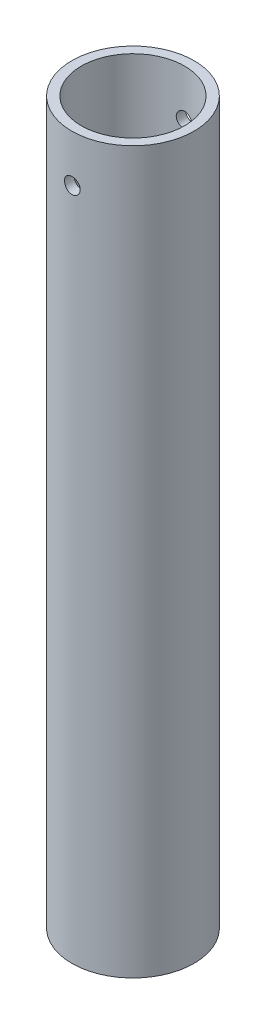
ISO-10303-21;
HEADER;
FILE_DESCRIPTION(('STEP AP214'),'2;1');
FILE_NAME('part.step','',(''),(''),'','','');
FILE_SCHEMA(('AUTOMOTIVE_DESIGN { 1 0 10303 214 1 1 1 1 }'));
ENDSEC;
DATA;
#1=APPLICATION_CONTEXT('core data for automotive mechanical design processes');
#2=APPLICATION_PROTOCOL_DEFINITION('international standard','automotive_design',2000,#1);
#3=PRODUCT_CONTEXT('',#1,'mechanical');
#4=PRODUCT('Part','Part','',(#3));
#5=PRODUCT_RELATED_PRODUCT_CATEGORY('part','',(#4));
#6=PRODUCT_DEFINITION_FORMATION('','',#4);
#7=PRODUCT_DEFINITION_CONTEXT('part definition',#1,'design');
#8=PRODUCT_DEFINITION('design','',#6,#7);
#9=PRODUCT_DEFINITION_SHAPE('','',#8);
#10=(LENGTH_UNIT() NAMED_UNIT(*) SI_UNIT(.MILLI.,.METRE.));
#11=(NAMED_UNIT(*) PLANE_ANGLE_UNIT() SI_UNIT($,.RADIAN.));
#12=(NAMED_UNIT(*) SI_UNIT($,.STERADIAN.) SOLID_ANGLE_UNIT());
#13=UNCERTAINTY_MEASURE_WITH_UNIT(LENGTH_MEASURE(1.E-05),#10,'distance_accuracy_value','');
#14=(GEOMETRIC_REPRESENTATION_CONTEXT(3) GLOBAL_UNCERTAINTY_ASSIGNED_CONTEXT((#13)) GLOBAL_UNIT_ASSIGNED_CONTEXT((#10,
#11,#12)) REPRESENTATION_CONTEXT('',''));
#15=CARTESIAN_POINT('',(0.,0.,0.));
#16=DIRECTION('',(0.,0.,1.));
#17=DIRECTION('',(1.,0.,0.));
#18=AXIS2_PLACEMENT_3D('',#15,#16,#17);
#19=CARTESIAN_POINT('',(0.,230.,0.));
#20=DIRECTION('',(0.,1.,0.));
#21=DIRECTION('',(0.,0.,1.));
#22=AXIS2_PLACEMENT_3D('',#19,#20,#21);
#23=PLANE('',#22);
#24=CARTESIAN_POINT('',(0.,230.,0.));
#25=DIRECTION('',(0.,1.,0.));
#26=DIRECTION('',(0.,0.,1.));
#27=AXIS2_PLACEMENT_3D('',#24,#25,#26);
#28=CIRCLE('',#27,19.5);
#29=CARTESIAN_POINT('',(0.,230.,19.5));
#30=VERTEX_POINT('',#29);
#31=EDGE_CURVE('E10',#30,#30,#28,.T.);
#32=ORIENTED_EDGE('',*,*,#31,.T.);
#33=EDGE_LOOP('',(#32));
#34=FACE_BOUND('',#33,.T.);
#35=CARTESIAN_POINT('',(0.,230.,0.));
#36=DIRECTION('',(0.,1.,0.));
#37=DIRECTION('',(0.,0.,1.));
#38=AXIS2_PLACEMENT_3D('',#35,#36,#37);
#39=CIRCLE('',#38,16.5);
#40=CARTESIAN_POINT('',(0.,230.,16.5));
#41=VERTEX_POINT('',#40);
#42=EDGE_CURVE('E57',#41,#41,#39,.T.);
#43=ORIENTED_EDGE('',*,*,#42,.F.);
#44=EDGE_LOOP('',(#43));
#45=FACE_BOUND('',#44,.T.);
#46=ADVANCED_FACE('F36',(#34,#45),#23,.T.);
#47=CARTESIAN_POINT('',(0.,0.,0.));
#48=DIRECTION('',(0.,1.,0.));
#49=DIRECTION('',(0.,0.,1.));
#50=AXIS2_PLACEMENT_3D('',#47,#48,#49);
#51=PLANE('',#50);
#52=CARTESIAN_POINT('',(0.,0.,0.));
#53=DIRECTION('',(0.,1.,0.));
#54=DIRECTION('',(0.,0.,1.));
#55=AXIS2_PLACEMENT_3D('',#52,#53,#54);
#56=CIRCLE('',#55,19.5);
#57=CARTESIAN_POINT('',(0.,0.,19.5));
#58=VERTEX_POINT('',#57);
#59=EDGE_CURVE('E51',#58,#58,#56,.T.);
#60=ORIENTED_EDGE('',*,*,#59,.F.);
#61=EDGE_LOOP('',(#60));
#62=FACE_BOUND('',#61,.T.);
#63=CARTESIAN_POINT('',(0.,0.,0.));
#64=DIRECTION('',(0.,1.,0.));
#65=DIRECTION('',(0.,0.,1.));
#66=AXIS2_PLACEMENT_3D('',#63,#64,#65);
#67=CIRCLE('',#66,16.5);
#68=CARTESIAN_POINT('',(0.,0.,16.5));
#69=VERTEX_POINT('',#68);
#70=EDGE_CURVE('E60',#69,#69,#67,.T.);
#71=ORIENTED_EDGE('',*,*,#70,.T.);
#72=EDGE_LOOP('',(#71));
#73=FACE_BOUND('',#72,.T.);
#74=ADVANCED_FACE('F101',(#62,#73),#51,.F.);
#75=CARTESIAN_POINT('',(0.,230.,0.));
#76=DIRECTION('',(0.,-1.,0.));
#77=DIRECTION('',(0.,0.,-1.));
#78=AXIS2_PLACEMENT_3D('',#75,#76,#77);
#79=CYLINDRICAL_SURFACE('',#78,19.5);
#80=CARTESIAN_POINT('',(0.,217.5,-19.5));
#81=CARTESIAN_POINT('',(-0.139810902473166,217.499994078924,-19.4999980089343));
#82=CARTESIAN_POINT('',(-0.279708435096052,217.488232197014,-19.4984805121829));
#83=CARTESIAN_POINT('',(-0.555608564068699,217.441498583943,-19.4925728926652));
#84=CARTESIAN_POINT('',(-0.69160697352553,217.406502811207,-19.4881797943986));
#85=CARTESIAN_POINT('',(-0.95567485821723,217.314351198933,-19.477015734038));
#86=CARTESIAN_POINT('',(-1.08374967947309,217.257210493838,-19.4702463962273));
#87=CARTESIAN_POINT('',(-1.32846845800077,217.12242461155,-19.4550821656547));
#88=CARTESIAN_POINT('',(-1.44511432712686,217.044782871859,-19.4466875454743));
#89=CARTESIAN_POINT('',(-1.66436190663268,216.87071940219,-19.4291553145839));
#90=CARTESIAN_POINT('',(-1.76688804172569,216.774202832759,-19.420014093483));
#91=CARTESIAN_POINT('',(-1.95433479205566,216.565333156187,-19.4020479414224));
#92=CARTESIAN_POINT('',(-2.03925449705906,216.452979230775,-19.393223026835));
#93=CARTESIAN_POINT('',(-2.18936091688951,216.215130946427,-19.3768532163871));
#94=CARTESIAN_POINT('',(-2.25447653775649,216.089591372103,-19.3693129739369));
#95=CARTESIAN_POINT('',(-2.36267233716729,215.829245845316,-19.3564140856209));
#96=CARTESIAN_POINT('',(-2.40575339391109,215.694440262398,-19.3510553528115));
#97=CARTESIAN_POINT('',(-2.468426864556,215.420175101947,-19.3431608393239));
#98=CARTESIAN_POINT('',(-2.48814712059045,215.280745188001,-19.3406096995788));
#99=CARTESIAN_POINT('',(-2.50393484558494,215.000533398314,-19.3385722680719));
#100=CARTESIAN_POINT('',(-2.50000331349924,214.859751579924,-19.339085846869));
#101=CARTESIAN_POINT('',(-2.46870395100759,214.581724641412,-19.3431057691563));
#102=CARTESIAN_POINT('',(-2.44147712732037,214.444463349799,-19.3465941059763));
#103=CARTESIAN_POINT('',(-2.36458014188295,214.176474097162,-19.3561424065145));
#104=CARTESIAN_POINT('',(-2.31490950385934,214.045746274847,-19.3622024248054));
#105=CARTESIAN_POINT('',(-2.19438387951879,213.794097862565,-19.3762316311233));
#106=CARTESIAN_POINT('',(-2.12346780166696,213.67320685074,-19.384206311473));
#107=CARTESIAN_POINT('',(-1.96250802434833,213.444987890501,-19.4011620838699));
#108=CARTESIAN_POINT('',(-1.87246340480414,213.337660594894,-19.4101432243177));
#109=CARTESIAN_POINT('',(-1.67502199733923,213.138797389367,-19.4281799565363));
#110=CARTESIAN_POINT('',(-1.56750370470073,213.047382078229,-19.437235614491));
#111=CARTESIAN_POINT('',(-1.33858485312347,212.883877417133,-19.4543399424612));
#112=CARTESIAN_POINT('',(-1.21718425927683,212.811788115771,-19.4623886099444));
#113=CARTESIAN_POINT('',(-0.963852555915909,212.688981015244,-19.4765774574665));
#114=CARTESIAN_POINT('',(-0.831917644168919,212.638270974513,-19.4827169444609));
#115=CARTESIAN_POINT('',(-0.561309109952617,212.559758678658,-19.4923894597022));
#116=CARTESIAN_POINT('',(-0.422635819809933,212.531955295023,-19.4959226163505));
#117=CARTESIAN_POINT('',(-0.143529482709649,212.500202334298,-19.4999676524948));
#118=CARTESIAN_POINT('',(-0.00311562430679432,212.496086666134,-19.5005005681924));
#119=CARTESIAN_POINT('',(0.276399868954183,212.511387347788,-19.498541929306));
#120=CARTESIAN_POINT('',(0.415501533172894,212.530803169819,-19.4960504425561));
#121=CARTESIAN_POINT('',(0.687952430516377,212.5924776898,-19.4883360408543));
#122=CARTESIAN_POINT('',(0.821319928884574,212.634656988931,-19.4831226220258));
#123=CARTESIAN_POINT('',(1.07908867017428,212.740578459576,-19.4705479002973));
#124=CARTESIAN_POINT('',(1.20348959413587,212.804321397695,-19.4631865210368));
#125=CARTESIAN_POINT('',(1.44053432594005,212.951961118874,-19.447083821545));
#126=CARTESIAN_POINT('',(1.55311086934735,213.035965094534,-19.4383352495542));
#127=CARTESIAN_POINT('',(1.76262635734994,213.221590965522,-19.4204589501491));
#128=CARTESIAN_POINT('',(1.85956464738636,213.323213597931,-19.4113312068843));
#129=CARTESIAN_POINT('',(2.03564298792671,213.541924656327,-19.3936601991894));
#130=CARTESIAN_POINT('',(2.11467278967044,213.659102195778,-19.3851207691166));
#131=CARTESIAN_POINT('',(2.25192859250564,213.905165395021,-19.3696569026763));
#132=CARTESIAN_POINT('',(2.31015502877009,214.034050809833,-19.3627324325275));
#133=CARTESIAN_POINT('',(2.40397367213347,214.299518649921,-19.3513088254167));
#134=CARTESIAN_POINT('',(2.43962754626324,214.436078985237,-19.3468030857861));
#135=CARTESIAN_POINT('',(2.48748731853607,214.713309993623,-19.3407083248742));
#136=CARTESIAN_POINT('',(2.49969436886963,214.853980464373,-19.3391191602709));
#137=CARTESIAN_POINT('',(2.50029209727037,215.134341578677,-19.339041801231));
#138=CARTESIAN_POINT('',(2.48885599279426,215.274031878255,-19.3405310532981));
#139=CARTESIAN_POINT('',(2.44285936653973,215.549487164945,-19.3463941753627));
#140=CARTESIAN_POINT('',(2.40829884634903,215.685252152325,-19.3507680451621));
#141=CARTESIAN_POINT('',(2.31708945805029,215.948977138383,-19.3619004935145));
#142=CARTESIAN_POINT('',(2.26044938589025,216.076940221702,-19.368658122335));
#143=CARTESIAN_POINT('',(2.12670572758751,216.321573903822,-19.3837981874031));
#144=CARTESIAN_POINT('',(2.04960183252793,216.438244332116,-19.3921806481783));
#145=CARTESIAN_POINT('',(1.87647806334041,216.657865745626,-19.4096994187056));
#146=CARTESIAN_POINT('',(1.78032916487468,216.760714641613,-19.418840608595));
#147=CARTESIAN_POINT('',(1.57211459120672,216.948883835619,-19.4368040373462));
#148=CARTESIAN_POINT('',(1.46004517585438,217.034200003181,-19.4456262006476));
#149=CARTESIAN_POINT('',(1.22265511122607,217.185174303006,-19.4619966939191));
#150=CARTESIAN_POINT('',(1.09728329721134,217.250752515587,-19.4695397925249));
#151=CARTESIAN_POINT('',(0.837278401860373,217.359829996536,-19.4824495172319));
#152=CARTESIAN_POINT('',(0.702655508045064,217.403353123695,-19.4878184939897));
#153=CARTESIAN_POINT('',(0.47278882661288,217.456730788472,-19.4944888518926));
#154=CARTESIAN_POINT('',(0.378991240257784,217.472933251007,-19.4965454001234));
#155=CARTESIAN_POINT('',(0.190142454160992,217.494569827792,-19.4993016459174));
#156=CARTESIAN_POINT('',(0.0950912643359407,217.500004027172,-19.5000013542074));
#157=CARTESIAN_POINT('',(0.,217.5,-19.5));
#158=B_SPLINE_CURVE_WITH_KNOTS('',3,(#80,#81,#82,#83,#84,#85,#86,#87,#88,#89,#90,#91,#92,#93,
#94,#95,#96,#97,#98,#99,#100,#101,#102,#103,#104,#105,#106,#107,#108,#109,#110,#111,#112,#113,
#114,#115,#116,#117,#118,#119,#120,#121,#122,#123,#124,#125,#126,#127,#128,#129,#130,#131,#132,
#133,#134,#135,#136,#137,#138,#139,#140,#141,#142,#143,#144,#145,#146,#147,#148,#149,#150,#151,
#152,#153,#154,#155,#156,#157),.UNSPECIFIED.,.T.,.F.,(4,2,2,2,2,2,2,2,2,2,2,2,2,2,2,2,2,2,2,2,2,
2,2,2,2,2,2,2,2,2,2,2,2,2,2,2,2,2,4),(0.,0.419085353459363,0.838605038321151,1.25783851627307,
1.67700174398193,2.09832789961591,2.51967583193202,2.94251896189283,3.36534523788852,
3.78584674466663,4.20633049131513,4.62428690578079,5.04225218999013,5.46143106677788,
5.88063011051726,6.30287969906674,6.7251303494118,7.14753410094152,7.56991704125923,
7.98933471811293,8.40874298805227,8.82669773194354,9.24466733603428,9.66489871257184,
10.0851476738638,10.5079174539255,10.9306783898049,11.3522793241624,11.7738595402757,
12.1923620700563,12.6108645711027,13.0292005211918,13.4475427867374,13.8688226096559,
14.2902015665097,14.713264433282,15.1358686560501,15.4209084525068,15.7059459955037),.UNSPECIFIED.);
#159=CARTESIAN_POINT('',(0.,217.5,-19.5));
#160=VERTEX_POINT('',#159);
#161=EDGE_CURVE('E87',#160,#160,#158,.T.);
#162=ORIENTED_EDGE('',*,*,#161,.T.);
#163=EDGE_LOOP('',(#162));
#164=FACE_BOUND('',#163,.T.);
#165=CARTESIAN_POINT('',(2.5,215.,19.3390796058137));
#166=CARTESIAN_POINT('',(2.4999940742566,214.860194420892,19.3390816586343));
#167=CARTESIAN_POINT('',(2.48823305776932,214.72030219615,19.3406119967665));
#168=CARTESIAN_POINT('',(2.44150319441811,214.444413094414,19.3465654712127));
#169=CARTESIAN_POINT('',(2.40651028716672,214.308420408508,19.3509916065247));
#170=CARTESIAN_POINT('',(2.31436705612945,214.044364630412,19.3622272873813));
#171=CARTESIAN_POINT('',(2.25723200263665,213.916296143747,19.3690351900302));
#172=CARTESIAN_POINT('',(2.12245943250047,213.671587994175,19.3842653525403));
#173=CARTESIAN_POINT('',(2.04482533964802,213.554946427177,19.392687342749));
#174=CARTESIAN_POINT('',(1.87076962022832,213.335694051195,19.4102521862101));
#175=CARTESIAN_POINT('',(1.77425144348259,213.233160165664,19.4193985938124));
#176=CARTESIAN_POINT('',(1.56537528983767,213.045698439253,19.4373497685318));
#177=CARTESIAN_POINT('',(1.45301651590683,212.96077148481,19.4461545184298));
#178=CARTESIAN_POINT('',(1.21516392244337,212.81065743547,19.4624668034246));
#179=CARTESIAN_POINT('',(1.08962572162875,212.745540116506,19.4699697140621));
#180=CARTESIAN_POINT('',(0.829283178153513,212.63734079964,19.4827938418134));
#181=CARTESIAN_POINT('',(0.694479196751456,212.594257943199,19.4881151439283));
#182=CARTESIAN_POINT('',(0.420219188035816,212.531580783848,19.4959514498186));
#183=CARTESIAN_POINT('',(0.280792862145056,212.511858457054,19.4984817439916));
#184=CARTESIAN_POINT('',(0.000588116196932462,212.496065347098,19.5005031754336));
#185=CARTESIAN_POINT('',(-0.140190247826183,212.499993587943,19.499994438115));
#186=CARTESIAN_POINT('',(-0.418231569099837,212.531287690502,19.4960074806327));
#187=CARTESIAN_POINT('',(-0.5555103092282,212.55851586039,19.4925467060293));
#188=CARTESIAN_POINT('',(-0.823533761952174,212.635421567213,19.4830640967861));
#189=CARTESIAN_POINT('',(-0.9542783448535,212.685099549551,19.4770422113343));
#190=CARTESIAN_POINT('',(-1.20594726486914,212.805640480785,19.4630839510432));
#191=CARTESIAN_POINT('',(-1.32684284488953,212.876562824277,19.4551422209098));
#192=CARTESIAN_POINT('',(-1.5550682941427,213.03753602825,19.438232384493));
#193=CARTESIAN_POINT('',(-1.66239750865066,213.127587811373,19.4292642287132));
#194=CARTESIAN_POINT('',(-1.86125280675794,213.325034361832,19.4112286785857));
#195=CARTESIAN_POINT('',(-1.95265973240252,213.432549155969,19.4021610343057));
#196=CARTESIAN_POINT('',(-2.11614913267405,213.661457998294,19.3850120314913));
#197=CARTESIAN_POINT('',(-2.18823154091202,213.782852094164,19.3769306763454));
#198=CARTESIAN_POINT('',(-2.31103365749075,214.036181909446,19.3626693821632));
#199=CARTESIAN_POINT('',(-2.3617435015523,214.168122463115,19.3564903214647));
#200=CARTESIAN_POINT('',(-2.44025368103158,214.438743279646,19.3467501512991));
#201=CARTESIAN_POINT('',(-2.46805517997602,214.577423199832,19.3431889088727));
#202=CARTESIAN_POINT('',(-2.49980101815164,214.856532822076,19.3391120147454));
#203=CARTESIAN_POINT('',(-2.50391319364998,214.996943133297,19.3385749377769));
#204=CARTESIAN_POINT('',(-2.48860679259682,215.276450697941,19.3405504947933));
#205=CARTESIAN_POINT('',(-2.46918874433199,215.415547980774,19.3430630603095));
#206=CARTESIAN_POINT('',(-2.40751454144652,215.687976055627,19.3508352333641));
#207=CARTESIAN_POINT('',(-2.36533993349814,215.821325612851,19.3560850299606));
#208=CARTESIAN_POINT('',(-2.25943384058702,216.079060542295,19.368732175058));
#209=CARTESIAN_POINT('',(-2.19570156112615,216.203445583928,19.3761296027073));
#210=CARTESIAN_POINT('',(-2.04807771040068,216.440479167734,19.3922897284133));
#211=CARTESIAN_POINT('',(-1.96407624349025,216.553058758032,19.4010597741919));
#212=CARTESIAN_POINT('',(-1.77845355452005,216.762581558879,19.4189540166536));
#213=CARTESIAN_POINT('',(-1.67683161075073,216.859524128645,19.428078227831));
#214=CARTESIAN_POINT('',(-1.45811875418368,217.035612184508,19.4457186842541));
#215=CARTESIAN_POINT('',(-1.34093859154282,217.114647272528,19.454230948478));
#216=CARTESIAN_POINT('',(-1.09486869161052,217.251912343393,19.4696286094673));
#217=CARTESIAN_POINT('',(-0.965979200835888,217.310142764113,19.4765140404715));
#218=CARTESIAN_POINT('',(-0.700513555956823,217.403963943853,19.4878645907391));
#219=CARTESIAN_POINT('',(-0.563960107830763,217.439618095863,19.4923364818298));
#220=CARTESIAN_POINT('',(-0.286743662517508,217.487480755927,19.4983842488421));
#221=CARTESIAN_POINT('',(-0.146080861087521,217.499690378965,19.4999602624869));
#222=CARTESIAN_POINT('',(0.134284306417267,217.500295805035,19.500037965928));
#223=CARTESIAN_POINT('',(0.273986329591736,217.488861678525,19.4985616115443));
#224=CARTESIAN_POINT('',(0.549465568143491,217.442864892578,19.4927441754248));
#225=CARTESIAN_POINT('',(0.685242787259144,217.408302255172,19.4884030964179));
#226=CARTESIAN_POINT('',(0.94899298683951,217.317083806996,19.4773417755241));
#227=CARTESIAN_POINT('',(1.07696897720479,217.260436580178,19.4706224581166));
#228=CARTESIAN_POINT('',(1.32162550162967,217.126674602155,19.4555479743168));
#229=CARTESIAN_POINT('',(1.43830587320914,217.049559556593,19.4471927843987));
#230=CARTESIAN_POINT('',(1.65792725439477,216.876423294201,19.429707056974));
#231=CARTESIAN_POINT('',(1.76076818398471,216.780275617974,19.4205715792637));
#232=CARTESIAN_POINT('',(1.94892187429143,216.572066797639,19.4025941814594));
#233=CARTESIAN_POINT('',(2.03423048337852,216.460001894951,19.3937523313105));
#234=CARTESIAN_POINT('',(2.18519637887008,216.222615731788,19.3773249970319));
#235=CARTESIAN_POINT('',(2.25077245689284,216.097242486919,19.3697447606572));
#236=CARTESIAN_POINT('',(2.35984555433095,215.837234606079,19.3567603939657));
#237=CARTESIAN_POINT('',(2.40336645802285,215.702610168786,19.3513539109368));
#238=CARTESIAN_POINT('',(2.45673804790746,215.472749396085,19.3446344768932));
#239=CARTESIAN_POINT('',(2.47293777717814,215.378959688215,19.342561852361));
#240=CARTESIAN_POINT('',(2.49457072444897,215.190126672775,19.3397837243169));
#241=CARTESIAN_POINT('',(2.50000403016595,215.095083375425,19.3390782096669));
#242=CARTESIAN_POINT('',(2.5,215.,19.3390796058137));
#243=B_SPLINE_CURVE_WITH_KNOTS('',3,(#165,#166,#167,#168,#169,#170,#171,#172,#173,#174,#175,
#176,#177,#178,#179,#180,#181,#182,#183,#184,#185,#186,#187,#188,#189,#190,#191,#192,#193,#194,
#195,#196,#197,#198,#199,#200,#201,#202,#203,#204,#205,#206,#207,#208,#209,#210,#211,#212,#213,
#214,#215,#216,#217,#218,#219,#220,#221,#222,#223,#224,#225,#226,#227,#228,#229,#230,#231,#232,
#233,#234,#235,#236,#237,#238,#239,#240,#241,#242),.UNSPECIFIED.,.T.,.F.,(4,2,2,2,2,2,2,2,2,2,2,
2,2,2,2,2,2,2,2,2,2,2,2,2,2,2,2,2,2,2,2,2,2,2,2,2,2,2,4),(0.,0.419069360921707,
0.838573414533693,1.25778867126691,1.67693395406297,2.09828104200711,2.51964933792083,
2.94248508819308,3.36530436208976,3.78579555615486,4.20626939782879,4.62427545846293,
5.04228981266608,5.46148392815995,5.88069826661546,6.3029263922482,6.72515596841836,
7.14758020730982,7.56998298973279,7.98938937856387,8.40878635130524,8.82669032709798,
9.2446097062294,9.66484799413427,10.0851034984668,10.5078833206206,10.9306542440414,
11.3522327219656,11.7737911498036,12.1923278409578,12.6108641334437,13.0292379090066,
13.4476177017105,13.8688767710675,14.2902354793541,14.7133052730487,15.1359159261693,
15.4209321198865,15.7059459914934),.UNSPECIFIED.);
#244=CARTESIAN_POINT('',(2.5,215.,19.3390796058137));
#245=VERTEX_POINT('',#244);
#246=EDGE_CURVE('E81',#245,#245,#243,.T.);
#247=ORIENTED_EDGE('',*,*,#246,.T.);
#248=EDGE_LOOP('',(#247));
#249=FACE_BOUND('',#248,.T.);
#250=ORIENTED_EDGE('',*,*,#31,.F.);
#251=EDGE_LOOP('',(#250));
#252=FACE_BOUND('',#251,.T.);
#253=ORIENTED_EDGE('',*,*,#59,.T.);
#254=EDGE_LOOP('',(#253));
#255=FACE_BOUND('',#254,.T.);
#256=ADVANCED_FACE('F38',(#164,#249,#252,#255),#79,.T.);
#257=CARTESIAN_POINT('',(0.,230.,0.));
#258=DIRECTION('',(0.,-1.,0.));
#259=DIRECTION('',(0.,0.,-1.));
#260=AXIS2_PLACEMENT_3D('',#257,#258,#259);
#261=CYLINDRICAL_SURFACE('',#260,16.5);
#262=CARTESIAN_POINT('',(0.,217.5,-16.5));
#263=CARTESIAN_POINT('',(-0.139568997452386,217.499994257236,-16.4999977476528));
#264=CARTESIAN_POINT('',(-0.279218562999125,217.488272837856,-16.4982105870402));
#265=CARTESIAN_POINT('',(-0.554613125820183,217.441709390289,-16.4912532584451));
#266=CARTESIAN_POINT('',(-0.690354206485444,217.406844958411,-16.4860798124227));
#267=CARTESIAN_POINT('',(-0.953906534647182,217.315062138858,-16.4729311954606));
#268=CARTESIAN_POINT('',(-1.0817237329161,217.258160539492,-16.4649581577308));
#269=CARTESIAN_POINT('',(-1.32597651388559,217.123959897081,-16.4470909962824));
#270=CARTESIAN_POINT('',(-1.44241364997912,217.046663643278,-16.4371971353109));
#271=CARTESIAN_POINT('',(-1.66154764510867,216.873212023672,-16.4165001477212));
#272=CARTESIAN_POINT('',(-1.76414074029147,216.776926264457,-16.4056910471797));
#273=CARTESIAN_POINT('',(-1.95177906511563,216.568509432122,-16.3844285015251));
#274=CARTESIAN_POINT('',(-2.03682327721791,216.456377440823,-16.3739750770647));
#275=CARTESIAN_POINT('',(-2.18735471298306,216.21875260905,-16.3545494950682));
#276=CARTESIAN_POINT('',(-2.25274134816779,216.093195361514,-16.3455850578477));
#277=CARTESIAN_POINT('',(-2.36145868570305,215.832722094594,-16.3302341066754));
#278=CARTESIAN_POINT('',(-2.40479061482506,215.697806596228,-16.3238474493412));
#279=CARTESIAN_POINT('',(-2.46784584311277,215.423538629236,-16.3144339675493));
#280=CARTESIAN_POINT('',(-2.48774691974327,215.28422791613,-16.3113818557403));
#281=CARTESIAN_POINT('',(-2.50392630256673,215.004213485082,-16.3089062866292));
#282=CARTESIAN_POINT('',(-2.50020599229007,214.863509849207,-16.3094826168053));
#283=CARTESIAN_POINT('',(-2.46939344901518,214.585960620716,-16.3141756935549));
#284=CARTESIAN_POINT('',(-2.44249936435956,214.449092449635,-16.3182624233836));
#285=CARTESIAN_POINT('',(-2.36641294577585,214.181833997364,-16.3294689284976));
#286=CARTESIAN_POINT('',(-2.31721996934142,214.05144390295,-16.3365887911774));
#287=CARTESIAN_POINT('',(-2.19772653963013,213.800240864343,-16.3530924237126));
#288=CARTESIAN_POINT('',(-2.12734229942807,213.679468388886,-16.3624851506325));
#289=CARTESIAN_POINT('',(-1.96752394760189,213.45137312485,-16.3824697345079));
#290=CARTESIAN_POINT('',(-1.87808856069975,213.344051237414,-16.3930616717158));
#291=CARTESIAN_POINT('',(-1.68161969101928,213.144755354356,-16.4143837896878));
#292=CARTESIAN_POINT('',(-1.57441587736974,213.052949223277,-16.4251142778832));
#293=CARTESIAN_POINT('',(-1.34603342177113,212.888605767714,-16.4454040614798));
#294=CARTESIAN_POINT('',(-1.22485471636073,212.816068530738,-16.454963351562));
#295=CARTESIAN_POINT('',(-0.971815721794939,212.69231271971,-16.4718439483926));
#296=CARTESIAN_POINT('',(-0.839948920979345,212.64110726033,-16.4791638776606));
#297=CARTESIAN_POINT('',(-0.569352134225958,212.561615330948,-16.4907295183001));
#298=CARTESIAN_POINT('',(-0.430622622485675,212.533327279747,-16.4949754417622));
#299=CARTESIAN_POINT('',(-0.151687057386775,212.500696752647,-16.4998865423229));
#300=CARTESIAN_POINT('',(-0.0115085829881242,212.496123526144,-16.5005862236411));
#301=CARTESIAN_POINT('',(0.267613344135318,212.510439746372,-16.49841997884));
#302=CARTESIAN_POINT('',(0.406556835753097,212.529328451568,-16.4955541654115));
#303=CARTESIAN_POINT('',(0.678564556456688,212.589840469929,-16.4866002804077));
#304=CARTESIAN_POINT('',(0.811654400666296,212.631351204939,-16.4805281695293));
#305=CARTESIAN_POINT('',(1.06898531960101,212.73581011421,-16.4658402835765));
#306=CARTESIAN_POINT('',(1.19322597114698,212.798759312853,-16.4572243869563));
#307=CARTESIAN_POINT('',(1.43034535898606,212.944848489983,-16.4383205169475));
#308=CARTESIAN_POINT('',(1.54313306605976,213.028134648496,-16.4280206247268));
#309=CARTESIAN_POINT('',(1.75321276039238,213.212330248238,-16.4069318528274));
#310=CARTESIAN_POINT('',(1.85050382712981,213.31324073563,-16.3961429441494));
#311=CARTESIAN_POINT('',(2.02766949282495,213.530848449461,-16.3751825194096));
#312=CARTESIAN_POINT('',(2.10738930198107,213.647672366164,-16.3650170189504));
#313=CARTESIAN_POINT('',(2.24607312771053,213.893188582591,-16.3465614341441));
#314=CARTESIAN_POINT('',(2.30503771397846,214.021880556435,-16.3382712983238));
#315=CARTESIAN_POINT('',(2.40029812933785,214.287020726779,-16.324548765394));
#316=CARTESIAN_POINT('',(2.43667503156284,214.423439243317,-16.3191061589608));
#317=CARTESIAN_POINT('',(2.48598526128158,214.700538130443,-16.3116678999976));
#318=CARTESIAN_POINT('',(2.49892024355462,214.841218199493,-16.3096720041627));
#319=CARTESIAN_POINT('',(2.50093949887771,215.121303723332,-16.3093623561849));
#320=CARTESIAN_POINT('',(2.49026717585728,215.260707442694,-16.3110110265066));
#321=CARTESIAN_POINT('',(2.44589678006129,215.535712923882,-16.3177230193832));
#322=CARTESIAN_POINT('',(2.41219874720724,215.671314692299,-16.3227863360179));
#323=CARTESIAN_POINT('',(2.32282019861313,215.934797256378,-16.3357438759955));
#324=CARTESIAN_POINT('',(2.26715703991028,216.062684056705,-16.3436358636471));
#325=CARTESIAN_POINT('',(2.13545259703983,216.307343028541,-16.3613641884847));
#326=CARTESIAN_POINT('',(2.05941059464865,216.424114808119,-16.3712005941958));
#327=CARTESIAN_POINT('',(1.88822405811481,216.644465076419,-16.3918301104082));
#328=CARTESIAN_POINT('',(1.79289935219714,216.747902818707,-16.4026316636391));
#329=CARTESIAN_POINT('',(1.58623408357501,216.937400048547,-16.4239042061856));
#330=CARTESIAN_POINT('',(1.47488980607089,217.023455494138,-16.4343751181395));
#331=CARTESIAN_POINT('',(1.23860885534675,217.176178501469,-16.4538739280201));
#332=CARTESIAN_POINT('',(1.11359928449034,217.242734343868,-16.4628933823142));
#333=CARTESIAN_POINT('',(0.854097195809869,217.353804639483,-16.4783903010556));
#334=CARTESIAN_POINT('',(0.719614631613478,217.398341845179,-16.4848703880603));
#335=CARTESIAN_POINT('',(0.487113114828224,217.454044671791,-16.4930848997806));
#336=CARTESIAN_POINT('',(0.390526922007675,217.471251473724,-16.4956646973583));
#337=CARTESIAN_POINT('',(0.195973716996646,217.494231080919,-16.4991230273835));
#338=CARTESIAN_POINT('',(0.0980067225076311,217.500004032625,-16.5000015816204));
#339=CARTESIAN_POINT('',(0.,217.5,-16.5));
#340=B_SPLINE_CURVE_WITH_KNOTS('',3,(#262,#263,#264,#265,#266,#267,#268,#269,#270,#271,#272,
#273,#274,#275,#276,#277,#278,#279,#280,#281,#282,#283,#284,#285,#286,#287,#288,#289,#290,#291,
#292,#293,#294,#295,#296,#297,#298,#299,#300,#301,#302,#303,#304,#305,#306,#307,#308,#309,#310,
#311,#312,#313,#314,#315,#316,#317,#318,#319,#320,#321,#322,#323,#324,#325,#326,#327,#328,#329,
#330,#331,#332,#333,#334,#335,#336,#337,#338,#339),.UNSPECIFIED.,.T.,.F.,(4,2,2,2,2,2,2,2,2,2,2,
2,2,2,2,2,2,2,2,2,2,2,2,2,2,2,2,2,2,2,2,2,2,2,2,2,2,2,4),(0.,0.418348855154561,
0.837103286425352,1.25553932860407,1.67391817372422,2.0952767013687,2.51665965383641,
2.94016350706254,3.36364380072528,3.78388987131382,4.20411132785922,4.62077492060965,
5.0374505196079,5.45579571983421,5.87416893276734,6.29681313733769,6.71945926125183,
7.14236484380733,7.56524124526808,7.98399513729014,8.40273579454463,8.81941137619319,
9.23610687041356,9.65589057087305,10.0756991977627,10.4990700457283,10.9224292719976,
11.3442600315172,11.7660610125887,12.1835332910606,12.6010048457296,13.0181471691685,
13.4353041961335,13.8565557584487,14.2779051632636,14.701623409228,15.1249028952405,
15.4186753379532,15.7124440180106),.UNSPECIFIED.);
#341=CARTESIAN_POINT('',(0.,217.5,-16.5));
#342=VERTEX_POINT('',#341);
#343=EDGE_CURVE('E41',#342,#342,#340,.T.);
#344=ORIENTED_EDGE('',*,*,#343,.F.);
#345=EDGE_LOOP('',(#344));
#346=FACE_BOUND('',#345,.T.);
#347=CARTESIAN_POINT('',(2.5,215.,16.3095064303001));
#348=CARTESIAN_POINT('',(2.49999424838557,214.860441368397,16.309508781292));
#349=CARTESIAN_POINT('',(2.48827451128468,214.720802141013,16.3113170969036));
#350=CARTESIAN_POINT('',(2.44171835219537,214.445429053263,16.3183499305768));
#351=CARTESIAN_POINT('',(2.40685948903231,214.309699117738,16.3235777649415));
#352=CARTESIAN_POINT('',(2.31509295520613,214.04617037198,16.3368442337908));
#353=CARTESIAN_POINT('',(2.25820233613411,213.918365516619,16.3448806940568));
#354=CARTESIAN_POINT('',(2.12402756303377,213.674133474052,16.3628563282319));
#355=CARTESIAN_POINT('',(2.04674617193604,213.557704748317,16.37279524431));
#356=CARTESIAN_POINT('',(1.87330966475981,213.338561491855,16.3935466681487));
#357=CARTESIAN_POINT('',(1.77702082621856,213.235953333612,16.4043650260533));
#358=CARTESIAN_POINT('',(1.56859147940296,213.048285869375,16.4256041836637));
#359=CARTESIAN_POINT('',(1.45645009437365,212.963227534647,16.4360249613402));
#360=CARTESIAN_POINT('',(1.21881679854731,212.812681142494,16.45535608561));
#361=CARTESIAN_POINT('',(1.09326209693903,212.747291131186,16.4642587722335));
#362=CARTESIAN_POINT('',(0.832794355157817,212.638566852833,16.4794858016566));
#363=CARTESIAN_POINT('',(0.697881819736662,212.595231397238,16.4858102833956));
#364=CARTESIAN_POINT('',(0.423623879475603,212.532169077175,16.4951270321513));
#365=CARTESIAN_POINT('',(0.284320312574439,212.512264033369,16.4981444359564));
#366=CARTESIAN_POINT('',(0.0043199443944512,212.496074239079,16.5005932187305));
#367=CARTESIAN_POINT('',(-0.136376777484943,212.499788150139,16.5000248009035));
#368=CARTESIAN_POINT('',(-0.41395371778945,212.53059037246,16.495386054184));
#369=CARTESIAN_POINT('',(-0.550855756859713,212.557486984795,16.4913444460892));
#370=CARTESIAN_POINT('',(-0.818180632405486,212.633590124895,16.4802454362291));
#371=CARTESIAN_POINT('',(-0.948603299277275,212.682797236318,16.4731879555668));
#372=CARTESIAN_POINT('',(-1.19984655477979,212.802320315751,16.4568008630313));
#373=CARTESIAN_POINT('',(-1.3206282355483,212.872716836525,16.4474626066676));
#374=CARTESIAN_POINT('',(-1.54873674062324,213.032561605922,16.4275544221171));
#375=CARTESIAN_POINT('',(-1.65606266078572,213.122011133699,16.416984411256));
#376=CARTESIAN_POINT('',(-1.85534328381534,213.318490276092,16.3956660412256));
#377=CARTESIAN_POINT('',(-1.9471329550293,213.425687275456,16.3849169566933));
#378=CARTESIAN_POINT('',(-2.11144641294298,213.654050148359,16.3645553066737));
#379=CARTESIAN_POINT('',(-2.18397007638779,213.775216111258,16.3549427484575));
#380=CARTESIAN_POINT('',(-2.30771601876122,214.028251159083,16.3379426558174));
#381=CARTESIAN_POINT('',(-2.35892108150868,214.160128792085,16.3305569210232));
#382=CARTESIAN_POINT('',(-2.43840892137457,214.430749196196,16.3188783708782));
#383=CARTESIAN_POINT('',(-2.46669334847642,214.569491472377,16.3145853328965));
#384=CARTESIAN_POINT('',(-2.49931016339129,214.848433748098,16.3096205434828));
#385=CARTESIAN_POINT('',(-2.50387660866078,214.988605771155,16.3089134067583));
#386=CARTESIAN_POINT('',(-2.4895491284894,215.26771318568,16.3111065112989));
#387=CARTESIAN_POINT('',(-2.47065594631158,215.406648616187,16.3140066382762));
#388=CARTESIAN_POINT('',(-2.41014412266077,215.678612262279,16.3230549764189));
#389=CARTESIAN_POINT('',(-2.36864230979677,215.811667076584,16.3291864843737));
#390=CARTESIAN_POINT('',(-2.26421292456412,216.068931864633,16.3439929201526));
#391=CARTESIAN_POINT('',(-2.20128427434607,216.193141393048,16.3526679759235));
#392=CARTESIAN_POINT('',(-2.05522603893806,216.430238314384,16.3716673108103));
#393=CARTESIAN_POINT('',(-1.97194507355909,216.543031462419,16.3820037402419));
#394=CARTESIAN_POINT('',(-1.78775645841788,216.753124539759,16.4031246627207));
#395=CARTESIAN_POINT('',(-1.68684779104204,216.850423573996,16.413909181608));
#396=CARTESIAN_POINT('',(-1.46923687724909,217.027608264997,16.4348218445733));
#397=CARTESIAN_POINT('',(-1.35240756110122,217.107338722479,16.444943623426));
#398=CARTESIAN_POINT('',(-1.10687753265132,217.246041208994,16.4632911641627));
#399=CARTESIAN_POINT('',(-0.978177150594581,217.305013815277,16.471516978769));
#400=CARTESIAN_POINT('',(-0.713040830285377,217.400279165176,16.4851178935144));
#401=CARTESIAN_POINT('',(-0.576635835535788,217.436656449184,16.4905036083175));
#402=CARTESIAN_POINT('',(-0.299565612523724,217.485972017684,16.4978620836248));
#403=CARTESIAN_POINT('',(-0.158900672246497,217.498911883037,16.4998350743178));
#404=CARTESIAN_POINT('',(0.121191853178056,217.50094611438,16.5001434097998));
#405=CARTESIAN_POINT('',(0.260617732680371,217.490277831352,16.4985149627295));
#406=CARTESIAN_POINT('',(0.535668582489155,217.445907751087,16.4918764884953));
#407=CARTESIAN_POINT('',(0.671293565686468,217.412206031977,16.4868664728016));
#408=CARTESIAN_POINT('',(0.934825324139702,217.322810559345,16.4740252338575));
#409=CARTESIAN_POINT('',(1.06273789683264,217.26713356839,16.4661961613604));
#410=CARTESIAN_POINT('',(1.30744269380946,217.135393429585,16.4485762664782));
#411=CARTESIAN_POINT('',(1.42423454217198,217.059329592916,16.4387853778111));
#412=CARTESIAN_POINT('',(1.64458575443618,216.88811815797,16.4182130162591));
#413=CARTESIAN_POINT('',(1.74800826113641,216.792795434834,16.4074229848109));
#414=CARTESIAN_POINT('',(1.93747567299457,216.586140517718,16.3861313846653));
#415=CARTESIAN_POINT('',(2.02351649521307,216.474804572739,16.3756298842429));
#416=CARTESIAN_POINT('',(2.17622270772348,216.238531259414,16.3560396582182));
#417=CARTESIAN_POINT('',(2.24277401618594,216.113519467778,16.346959390353));
#418=CARTESIAN_POINT('',(2.3538352311253,215.854012867874,16.3313389644563));
#419=CARTESIAN_POINT('',(2.39836793771672,215.719528034489,16.324796180398));
#420=CARTESIAN_POINT('',(2.45405885885733,215.487038375863,16.3164978906713));
#421=CARTESIAN_POINT('',(2.47126031639507,215.390467133706,16.313890052321));
#422=CARTESIAN_POINT('',(2.49423282980328,215.195943827196,16.3103935082494));
#423=CARTESIAN_POINT('',(2.50000403852443,215.097991781327,16.3095047795395));
#424=CARTESIAN_POINT('',(2.5,215.,16.3095064303001));
#425=B_SPLINE_CURVE_WITH_KNOTS('',3,(#347,#348,#349,#350,#351,#352,#353,#354,#355,#356,#357,
#358,#359,#360,#361,#362,#363,#364,#365,#366,#367,#368,#369,#370,#371,#372,#373,#374,#375,#376,
#377,#378,#379,#380,#381,#382,#383,#384,#385,#386,#387,#388,#389,#390,#391,#392,#393,#394,#395,
#396,#397,#398,#399,#400,#401,#402,#403,#404,#405,#406,#407,#408,#409,#410,#411,#412,#413,#414,
#415,#416,#417,#418,#419,#420,#421,#422,#423,#424),.UNSPECIFIED.,.T.,.F.,(4,2,2,2,2,2,2,2,2,2,2,
2,2,2,2,2,2,2,2,2,2,2,2,2,2,2,2,2,2,2,2,2,2,2,2,2,2,2,4),(0.,0.418317709291121,
0.837041712373887,1.25544228744157,1.67378619870972,2.09518549623164,2.51660810916119,
2.94009795463004,3.36356497523617,3.78379044831452,4.20399210797086,4.62075207443092,
5.03752294423706,5.45589864402401,5.87430244102241,6.29690429069438,6.71950884391019,
7.14245401938009,7.56536874567098,7.98410195993879,8.40282190796944,8.81939839382174,
9.2359958381132,9.65579163948818,10.0756116828868,10.4990036250492,10.9223837922751,
11.344170187215,11.7659281314873,12.1834650993432,12.6010006509397,13.0182183232422,
13.4354500940328,13.8566619829951,14.2779726994342,14.7017024016959,15.124992410952,
15.418720181098,15.712444023351),.UNSPECIFIED.);
#426=CARTESIAN_POINT('',(2.5,215.,16.3095064303001));
#427=VERTEX_POINT('',#426);
#428=EDGE_CURVE('E62',#427,#427,#425,.T.);
#429=ORIENTED_EDGE('',*,*,#428,.F.);
#430=EDGE_LOOP('',(#429));
#431=FACE_BOUND('',#430,.T.);
#432=ORIENTED_EDGE('',*,*,#42,.T.);
#433=EDGE_LOOP('',(#432));
#434=FACE_BOUND('',#433,.T.);
#435=ORIENTED_EDGE('',*,*,#70,.F.);
#436=EDGE_LOOP('',(#435));
#437=FACE_BOUND('',#436,.T.);
#438=ADVANCED_FACE('F68',(#346,#431,#434,#437),#261,.F.);
#439=CARTESIAN_POINT('',(0.,215.,-19.5));
#440=DIRECTION('',(0.,0.,1.));
#441=DIRECTION('',(1.,0.,0.));
#442=AXIS2_PLACEMENT_3D('',#439,#440,#441);
#443=CYLINDRICAL_SURFACE('',#442,2.5);
#444=ORIENTED_EDGE('',*,*,#428,.T.);
#445=EDGE_LOOP('',(#444));
#446=FACE_BOUND('',#445,.T.);
#447=ORIENTED_EDGE('',*,*,#246,.F.);
#448=EDGE_LOOP('',(#447));
#449=FACE_BOUND('',#448,.T.);
#450=ADVANCED_FACE('F74',(#446,#449),#443,.F.);
#451=ORIENTED_EDGE('',*,*,#343,.T.);
#452=EDGE_LOOP('',(#451));
#453=FACE_BOUND('',#452,.T.);
#454=ORIENTED_EDGE('',*,*,#161,.F.);
#455=EDGE_LOOP('',(#454));
#456=FACE_BOUND('',#455,.T.);
#457=ADVANCED_FACE('F71',(#453,#456),#443,.F.);
#458=CLOSED_SHELL('',(#46,#74,#256,#438,#450,#457));
#459=MANIFOLD_SOLID_BREP('B2',#458);
#460=ADVANCED_BREP_SHAPE_REPRESENTATION('',(#18,#459),#14);
#461=SHAPE_DEFINITION_REPRESENTATION(#9,#460);
ENDSEC;
END-ISO-10303-21;
